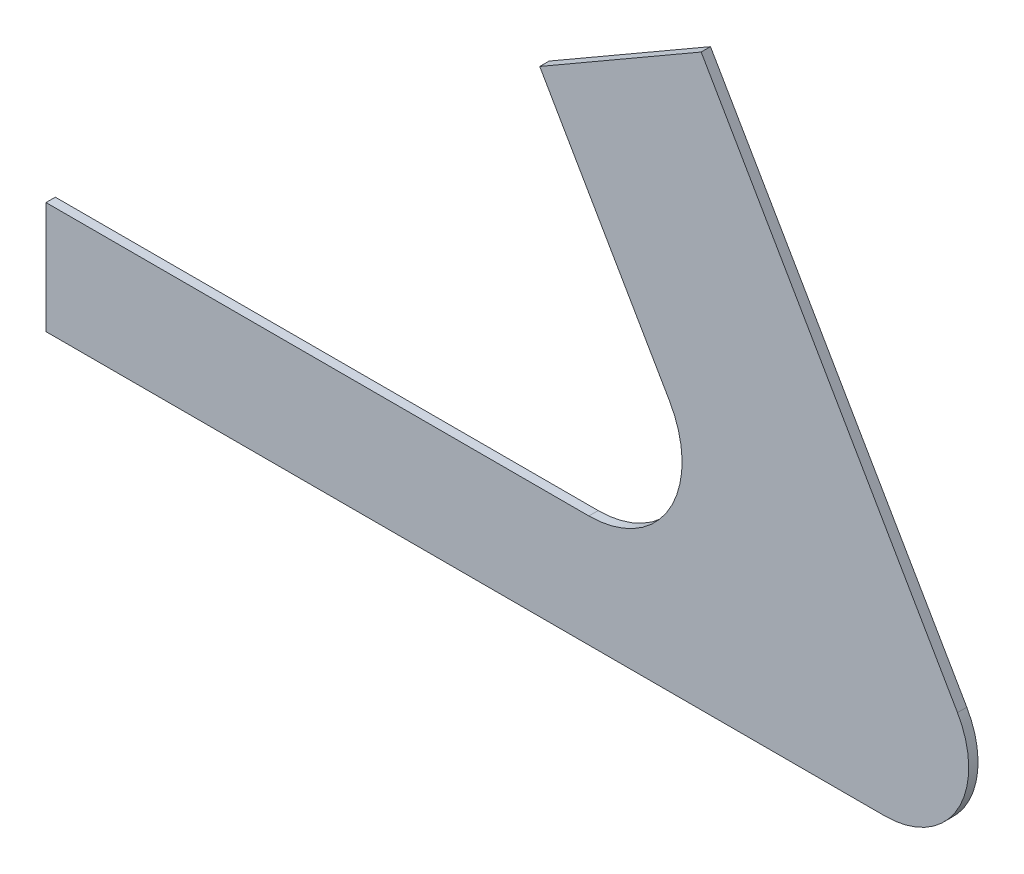
ISO-10303-21;
HEADER;
FILE_DESCRIPTION(('STEP AP214'),'2;1');
FILE_NAME('part.step','',(''),(''),'','','');
FILE_SCHEMA(('AUTOMOTIVE_DESIGN { 1 0 10303 214 1 1 1 1 }'));
ENDSEC;
DATA;
#1=APPLICATION_CONTEXT('core data for automotive mechanical design processes');
#2=APPLICATION_PROTOCOL_DEFINITION('international standard','automotive_design',2000,#1);
#3=PRODUCT_CONTEXT('',#1,'mechanical');
#4=PRODUCT('Part','Part','',(#3));
#5=PRODUCT_RELATED_PRODUCT_CATEGORY('part','',(#4));
#6=PRODUCT_DEFINITION_FORMATION('','',#4);
#7=PRODUCT_DEFINITION_CONTEXT('part definition',#1,'design');
#8=PRODUCT_DEFINITION('design','',#6,#7);
#9=PRODUCT_DEFINITION_SHAPE('','',#8);
#10=(LENGTH_UNIT() NAMED_UNIT(*) SI_UNIT(.MILLI.,.METRE.));
#11=(NAMED_UNIT(*) PLANE_ANGLE_UNIT() SI_UNIT($,.RADIAN.));
#12=(NAMED_UNIT(*) SI_UNIT($,.STERADIAN.) SOLID_ANGLE_UNIT());
#13=UNCERTAINTY_MEASURE_WITH_UNIT(LENGTH_MEASURE(1.E-05),#10,'distance_accuracy_value','');
#14=(GEOMETRIC_REPRESENTATION_CONTEXT(3) GLOBAL_UNCERTAINTY_ASSIGNED_CONTEXT((#13)) GLOBAL_UNIT_ASSIGNED_CONTEXT((#10,
#11,#12)) REPRESENTATION_CONTEXT('',''));
#15=CARTESIAN_POINT('',(0.,0.,0.));
#16=DIRECTION('',(0.,0.,1.));
#17=DIRECTION('',(1.,0.,0.));
#18=AXIS2_PLACEMENT_3D('',#15,#16,#17);
#19=CARTESIAN_POINT('',(90.,0.,1.));
#20=DIRECTION('',(0.,1.,0.));
#21=DIRECTION('',(0.,0.,1.));
#22=AXIS2_PLACEMENT_3D('',#19,#20,#21);
#23=PLANE('',#22);
#24=DIRECTION('',(1.,0.,0.));
#25=VECTOR('',#24,1.);
#26=CARTESIAN_POINT('',(90.,0.,0.));
#27=LINE('',#26,#25);
#28=CARTESIAN_POINT('',(0.,0.,0.));
#29=VERTEX_POINT('',#28);
#30=CARTESIAN_POINT('',(90.,0.,0.));
#31=VERTEX_POINT('',#30);
#32=EDGE_CURVE('E129',#29,#31,#27,.T.);
#33=ORIENTED_EDGE('',*,*,#32,.T.);
#34=DIRECTION('',(0.,0.,-1.));
#35=VECTOR('',#34,1.);
#36=CARTESIAN_POINT('',(90.,0.,1.));
#37=LINE('',#36,#35);
#38=CARTESIAN_POINT('',(90.,0.,1.));
#39=VERTEX_POINT('',#38);
#40=EDGE_CURVE('E11',#39,#31,#37,.T.);
#41=ORIENTED_EDGE('',*,*,#40,.F.);
#42=DIRECTION('',(1.,0.,0.));
#43=VECTOR('',#42,1.);
#44=CARTESIAN_POINT('',(90.,0.,1.));
#45=LINE('',#44,#43);
#46=CARTESIAN_POINT('',(0.,0.,1.));
#47=VERTEX_POINT('',#46);
#48=EDGE_CURVE('E143',#47,#39,#45,.T.);
#49=ORIENTED_EDGE('',*,*,#48,.F.);
#50=DIRECTION('',(0.,0.,-1.));
#51=VECTOR('',#50,1.);
#52=CARTESIAN_POINT('',(0.,0.,1.));
#53=LINE('',#52,#51);
#54=EDGE_CURVE('E125',#47,#29,#53,.T.);
#55=ORIENTED_EDGE('',*,*,#54,.T.);
#56=EDGE_LOOP('',(#33,#41,#49,#55));
#57=FACE_BOUND('',#56,.T.);
#58=ADVANCED_FACE('F33',(#57),#23,.F.);
#59=CARTESIAN_POINT('',(89.9999999999997,9.00000000000001,1.));
#60=DIRECTION('',(0.,0.,-1.));
#61=DIRECTION('',(-1.,0.,0.));
#62=AXIS2_PLACEMENT_3D('',#59,#60,#61);
#63=CYLINDRICAL_SURFACE('',#62,9.00000000000001);
#64=CARTESIAN_POINT('',(89.9999999999997,9.00000000000001,0.));
#65=DIRECTION('',(0.,0.,1.));
#66=DIRECTION('',(1.,0.,0.));
#67=AXIS2_PLACEMENT_3D('',#64,#65,#66);
#68=CIRCLE('',#67,9.00000000000001);
#69=CARTESIAN_POINT('',(97.7942286340596,13.5,0.));
#70=VERTEX_POINT('',#69);
#71=EDGE_CURVE('E132',#31,#70,#68,.T.);
#72=ORIENTED_EDGE('',*,*,#71,.T.);
#73=DIRECTION('',(0.,0.,-1.));
#74=VECTOR('',#73,1.);
#75=CARTESIAN_POINT('',(97.7942286340596,13.5,1.));
#76=LINE('',#75,#74);
#77=CARTESIAN_POINT('',(97.7942286340596,13.5,1.));
#78=VERTEX_POINT('',#77);
#79=EDGE_CURVE('E41',#78,#70,#76,.T.);
#80=ORIENTED_EDGE('',*,*,#79,.F.);
#81=CARTESIAN_POINT('',(89.9999999999997,9.00000000000001,1.));
#82=DIRECTION('',(0.,0.,1.));
#83=DIRECTION('',(1.,0.,0.));
#84=AXIS2_PLACEMENT_3D('',#81,#82,#83);
#85=CIRCLE('',#84,9.00000000000001);
#86=EDGE_CURVE('E92',#39,#78,#85,.T.);
#87=ORIENTED_EDGE('',*,*,#86,.F.);
#88=ORIENTED_EDGE('',*,*,#40,.T.);
#89=EDGE_LOOP('',(#72,#80,#87,#88));
#90=FACE_BOUND('',#89,.T.);
#91=ADVANCED_FACE('F178',(#90),#63,.T.);
#92=CARTESIAN_POINT('',(97.7942286340596,13.5,1.));
#93=DIRECTION('',(-0.866025403784439,-0.5,0.));
#94=DIRECTION('',(0.5,-0.866025403784439,0.));
#95=AXIS2_PLACEMENT_3D('',#92,#93,#94);
#96=PLANE('',#95);
#97=DIRECTION('',(-0.5,0.866025403784439,0.));
#98=VECTOR('',#97,1.);
#99=CARTESIAN_POINT('',(97.7942286340596,13.5,0.));
#100=LINE('',#99,#98);
#101=CARTESIAN_POINT('',(70.2942286340597,61.1313972081441,0.));
#102=VERTEX_POINT('',#101);
#103=EDGE_CURVE('E134',#70,#102,#100,.T.);
#104=ORIENTED_EDGE('',*,*,#103,.T.);
#105=DIRECTION('',(0.,0.,-1.));
#106=VECTOR('',#105,1.);
#107=CARTESIAN_POINT('',(70.2942286340597,61.1313972081441,1.));
#108=LINE('',#107,#106);
#109=CARTESIAN_POINT('',(70.2942286340597,61.1313972081441,1.));
#110=VERTEX_POINT('',#109);
#111=EDGE_CURVE('E150',#110,#102,#108,.T.);
#112=ORIENTED_EDGE('',*,*,#111,.F.);
#113=DIRECTION('',(-0.5,0.866025403784439,0.));
#114=VECTOR('',#113,1.);
#115=CARTESIAN_POINT('',(97.7942286340596,13.5,1.));
#116=LINE('',#115,#114);
#117=EDGE_CURVE('E158',#78,#110,#116,.T.);
#118=ORIENTED_EDGE('',*,*,#117,.F.);
#119=ORIENTED_EDGE('',*,*,#79,.T.);
#120=EDGE_LOOP('',(#104,#112,#118,#119));
#121=FACE_BOUND('',#120,.T.);
#122=ADVANCED_FACE('F156',(#121),#96,.F.);
#123=CARTESIAN_POINT('',(70.2942286340597,61.1313972081441,1.));
#124=DIRECTION('',(0.5,-0.866025403784439,0.));
#125=DIRECTION('',(0.866025403784439,0.5,0.));
#126=AXIS2_PLACEMENT_3D('',#123,#124,#125);
#127=PLANE('',#126);
#128=DIRECTION('',(-0.866025403784439,-0.5,0.));
#129=VECTOR('',#128,1.);
#130=CARTESIAN_POINT('',(70.2942286340597,61.1313972081441,0.));
#131=LINE('',#130,#129);
#132=CARTESIAN_POINT('',(52.9737205583709,51.1313972081441,0.));
#133=VERTEX_POINT('',#132);
#134=EDGE_CURVE('E136',#102,#133,#131,.T.);
#135=ORIENTED_EDGE('',*,*,#134,.T.);
#136=DIRECTION('',(0.,0.,-1.));
#137=VECTOR('',#136,1.);
#138=CARTESIAN_POINT('',(52.9737205583709,51.1313972081441,1.));
#139=LINE('',#138,#137);
#140=CARTESIAN_POINT('',(52.9737205583709,51.1313972081441,1.));
#141=VERTEX_POINT('',#140);
#142=EDGE_CURVE('E147',#141,#133,#139,.T.);
#143=ORIENTED_EDGE('',*,*,#142,.F.);
#144=DIRECTION('',(-0.866025403784439,-0.5,0.));
#145=VECTOR('',#144,1.);
#146=CARTESIAN_POINT('',(70.2942286340597,61.1313972081441,1.));
#147=LINE('',#146,#145);
#148=EDGE_CURVE('E170',#110,#141,#147,.T.);
#149=ORIENTED_EDGE('',*,*,#148,.F.);
#150=ORIENTED_EDGE('',*,*,#111,.T.);
#151=EDGE_LOOP('',(#135,#143,#149,#150));
#152=FACE_BOUND('',#151,.T.);
#153=ADVANCED_FACE('F166',(#152),#127,.F.);
#154=CARTESIAN_POINT('',(52.9737205583709,51.1313972081441,1.));
#155=DIRECTION('',(0.866025403784439,0.5,0.));
#156=DIRECTION('',(-0.5,0.866025403784439,0.));
#157=AXIS2_PLACEMENT_3D('',#154,#155,#156);
#158=PLANE('',#157);
#159=DIRECTION('',(0.5,-0.866025403784439,0.));
#160=VECTOR('',#159,1.);
#161=CARTESIAN_POINT('',(52.9737205583709,51.1313972081441,0.));
#162=LINE('',#161,#160);
#163=CARTESIAN_POINT('',(66.9059892324147,27.,0.));
#164=VERTEX_POINT('',#163);
#165=EDGE_CURVE('E138',#133,#164,#162,.T.);
#166=ORIENTED_EDGE('',*,*,#165,.T.);
#167=DIRECTION('',(0.,0.,-1.));
#168=VECTOR('',#167,1.);
#169=CARTESIAN_POINT('',(66.9059892324147,27.,1.));
#170=LINE('',#169,#168);
#171=CARTESIAN_POINT('',(66.9059892324147,27.,1.));
#172=VERTEX_POINT('',#171);
#173=EDGE_CURVE('E120',#172,#164,#170,.T.);
#174=ORIENTED_EDGE('',*,*,#173,.F.);
#175=DIRECTION('',(0.5,-0.866025403784439,0.));
#176=VECTOR('',#175,1.);
#177=CARTESIAN_POINT('',(52.9737205583709,51.1313972081441,1.));
#178=LINE('',#177,#176);
#179=EDGE_CURVE('E111',#141,#172,#178,.T.);
#180=ORIENTED_EDGE('',*,*,#179,.F.);
#181=ORIENTED_EDGE('',*,*,#142,.T.);
#182=EDGE_LOOP('',(#166,#174,#180,#181));
#183=FACE_BOUND('',#182,.T.);
#184=ADVANCED_FACE('F169',(#183),#158,.F.);
#185=CARTESIAN_POINT('',(58.2457351945703,22.,1.));
#186=DIRECTION('',(0.,0.,-1.));
#187=DIRECTION('',(-1.,0.,0.));
#188=AXIS2_PLACEMENT_3D('',#185,#186,#187);
#189=CYLINDRICAL_SURFACE('',#188,10.);
#190=CARTESIAN_POINT('',(58.2457351945703,22.,0.));
#191=DIRECTION('',(0.,0.,-1.));
#192=DIRECTION('',(-1.,0.,0.));
#193=AXIS2_PLACEMENT_3D('',#190,#191,#192);
#194=CIRCLE('',#193,10.);
#195=CARTESIAN_POINT('',(58.2457351945703,12.,0.));
#196=VERTEX_POINT('',#195);
#197=EDGE_CURVE('E119',#164,#196,#194,.T.);
#198=ORIENTED_EDGE('',*,*,#197,.T.);
#199=DIRECTION('',(0.,0.,-1.));
#200=VECTOR('',#199,1.);
#201=CARTESIAN_POINT('',(58.2457351945703,12.,1.));
#202=LINE('',#201,#200);
#203=CARTESIAN_POINT('',(58.2457351945703,12.,1.));
#204=VERTEX_POINT('',#203);
#205=EDGE_CURVE('E116',#204,#196,#202,.T.);
#206=ORIENTED_EDGE('',*,*,#205,.F.);
#207=CARTESIAN_POINT('',(58.2457351945703,22.,1.));
#208=DIRECTION('',(0.,0.,-1.));
#209=DIRECTION('',(-1.,0.,0.));
#210=AXIS2_PLACEMENT_3D('',#207,#208,#209);
#211=CIRCLE('',#210,10.);
#212=EDGE_CURVE('E105',#172,#204,#211,.T.);
#213=ORIENTED_EDGE('',*,*,#212,.F.);
#214=ORIENTED_EDGE('',*,*,#173,.T.);
#215=EDGE_LOOP('',(#198,#206,#213,#214));
#216=FACE_BOUND('',#215,.T.);
#217=ADVANCED_FACE('F117',(#216),#189,.F.);
#218=CARTESIAN_POINT('',(0.,12.,1.));
#219=DIRECTION('',(0.,-1.,0.));
#220=DIRECTION('',(0.,0.,-1.));
#221=AXIS2_PLACEMENT_3D('',#218,#219,#220);
#222=PLANE('',#221);
#223=DIRECTION('',(-1.,0.,0.));
#224=VECTOR('',#223,1.);
#225=CARTESIAN_POINT('',(0.,12.,0.));
#226=LINE('',#225,#224);
#227=CARTESIAN_POINT('',(0.,12.,0.));
#228=VERTEX_POINT('',#227);
#229=EDGE_CURVE('E78',#196,#228,#226,.T.);
#230=ORIENTED_EDGE('',*,*,#229,.T.);
#231=DIRECTION('',(0.,0.,-1.));
#232=VECTOR('',#231,1.);
#233=CARTESIAN_POINT('',(0.,12.,1.));
#234=LINE('',#233,#232);
#235=CARTESIAN_POINT('',(0.,12.,1.));
#236=VERTEX_POINT('',#235);
#237=EDGE_CURVE('E121',#236,#228,#234,.T.);
#238=ORIENTED_EDGE('',*,*,#237,.F.);
#239=DIRECTION('',(-1.,0.,0.));
#240=VECTOR('',#239,1.);
#241=CARTESIAN_POINT('',(0.,12.,1.));
#242=LINE('',#241,#240);
#243=EDGE_CURVE('E109',#204,#236,#242,.T.);
#244=ORIENTED_EDGE('',*,*,#243,.F.);
#245=ORIENTED_EDGE('',*,*,#205,.T.);
#246=EDGE_LOOP('',(#230,#238,#244,#245));
#247=FACE_BOUND('',#246,.T.);
#248=ADVANCED_FACE('F123',(#247),#222,.F.);
#249=CARTESIAN_POINT('',(0.,0.,1.));
#250=DIRECTION('',(1.,0.,0.));
#251=DIRECTION('',(0.,0.,-1.));
#252=AXIS2_PLACEMENT_3D('',#249,#250,#251);
#253=PLANE('',#252);
#254=DIRECTION('',(0.,-1.,0.));
#255=VECTOR('',#254,1.);
#256=CARTESIAN_POINT('',(0.,0.,0.));
#257=LINE('',#256,#255);
#258=EDGE_CURVE('E84',#228,#29,#257,.T.);
#259=ORIENTED_EDGE('',*,*,#258,.T.);
#260=ORIENTED_EDGE('',*,*,#54,.F.);
#261=DIRECTION('',(0.,-1.,0.));
#262=VECTOR('',#261,1.);
#263=CARTESIAN_POINT('',(0.,0.,1.));
#264=LINE('',#263,#262);
#265=EDGE_CURVE('E49',#236,#47,#264,.T.);
#266=ORIENTED_EDGE('',*,*,#265,.F.);
#267=ORIENTED_EDGE('',*,*,#237,.T.);
#268=EDGE_LOOP('',(#259,#260,#266,#267));
#269=FACE_BOUND('',#268,.T.);
#270=ADVANCED_FACE('F194',(#269),#253,.F.);
#271=CARTESIAN_POINT('',(58.2457351945703,22.,1.));
#272=DIRECTION('',(0.,0.,-1.));
#273=DIRECTION('',(-1.,0.,0.));
#274=AXIS2_PLACEMENT_3D('',#271,#272,#273);
#275=PLANE('',#274);
#276=ORIENTED_EDGE('',*,*,#48,.T.);
#277=ORIENTED_EDGE('',*,*,#86,.T.);
#278=ORIENTED_EDGE('',*,*,#117,.T.);
#279=ORIENTED_EDGE('',*,*,#148,.T.);
#280=ORIENTED_EDGE('',*,*,#179,.T.);
#281=ORIENTED_EDGE('',*,*,#212,.T.);
#282=ORIENTED_EDGE('',*,*,#243,.T.);
#283=ORIENTED_EDGE('',*,*,#265,.T.);
#284=EDGE_LOOP('',(#276,#277,#278,#279,#280,#281,#282,#283));
#285=FACE_BOUND('',#284,.T.);
#286=ADVANCED_FACE('F107',(#285),#275,.F.);
#287=CARTESIAN_POINT('',(58.2457351945703,22.,0.));
#288=DIRECTION('',(0.,0.,-1.));
#289=DIRECTION('',(-1.,0.,0.));
#290=AXIS2_PLACEMENT_3D('',#287,#288,#289);
#291=PLANE('',#290);
#292=ORIENTED_EDGE('',*,*,#32,.F.);
#293=ORIENTED_EDGE('',*,*,#258,.F.);
#294=ORIENTED_EDGE('',*,*,#229,.F.);
#295=ORIENTED_EDGE('',*,*,#197,.F.);
#296=ORIENTED_EDGE('',*,*,#165,.F.);
#297=ORIENTED_EDGE('',*,*,#134,.F.);
#298=ORIENTED_EDGE('',*,*,#103,.F.);
#299=ORIENTED_EDGE('',*,*,#71,.F.);
#300=EDGE_LOOP('',(#292,#293,#294,#295,#296,#297,#298,#299));
#301=FACE_BOUND('',#300,.T.);
#302=ADVANCED_FACE('F162',(#301),#291,.T.);
#303=CLOSED_SHELL('',(#58,#91,#122,#153,#184,#217,#248,#270,#286,#302));
#304=MANIFOLD_SOLID_BREP('B2',#303);
#305=ADVANCED_BREP_SHAPE_REPRESENTATION('',(#18,#304),#14);
#306=SHAPE_DEFINITION_REPRESENTATION(#9,#305);
ENDSEC;
END-ISO-10303-21;
